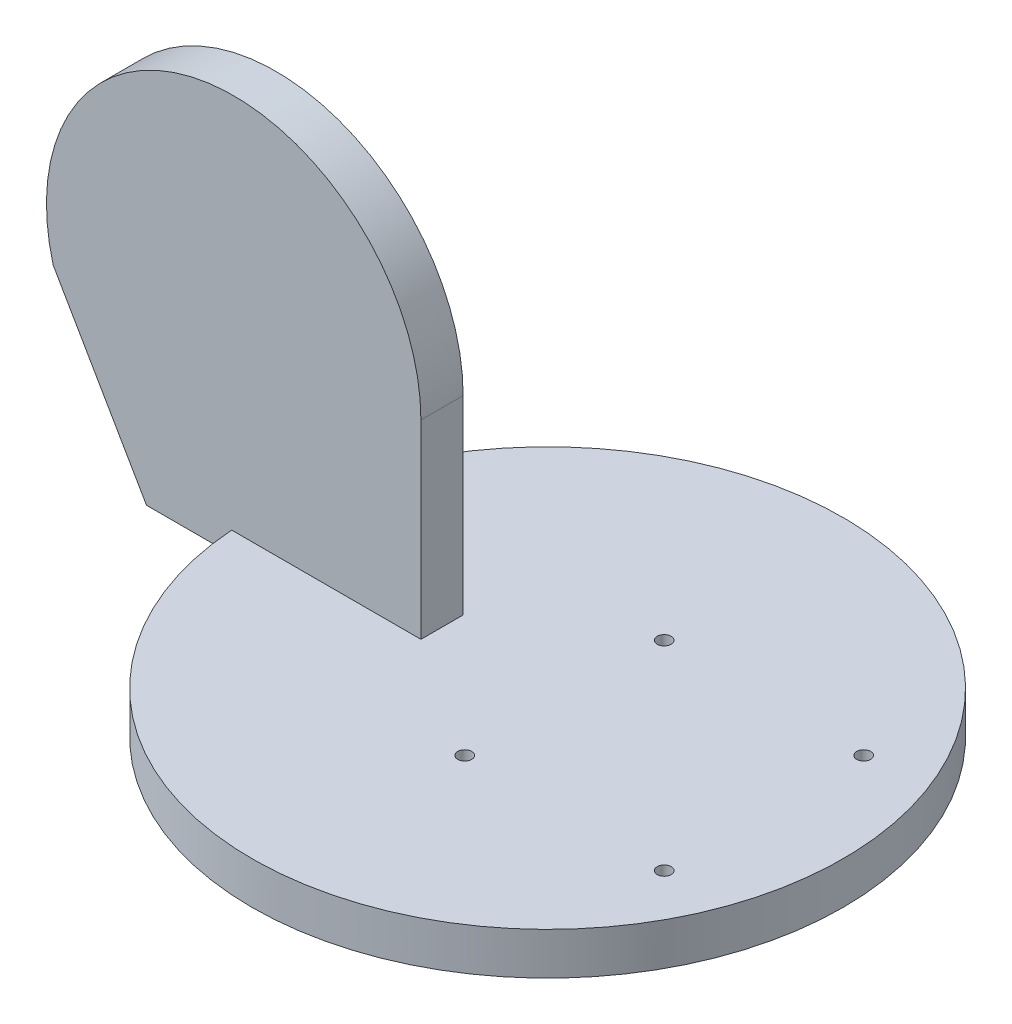
ISO-10303-21;
HEADER;
FILE_DESCRIPTION(('STEP AP214'),'2;1');
FILE_NAME('part.step','',(''),(''),'','','');
FILE_SCHEMA(('AUTOMOTIVE_DESIGN { 1 0 10303 214 1 1 1 1 }'));
ENDSEC;
DATA;
#1=APPLICATION_CONTEXT('core data for automotive mechanical design processes');
#2=APPLICATION_PROTOCOL_DEFINITION('international standard','automotive_design',2000,#1);
#3=PRODUCT_CONTEXT('',#1,'mechanical');
#4=PRODUCT('Part','Part','',(#3));
#5=PRODUCT_RELATED_PRODUCT_CATEGORY('part','',(#4));
#6=PRODUCT_DEFINITION_FORMATION('','',#4);
#7=PRODUCT_DEFINITION_CONTEXT('part definition',#1,'design');
#8=PRODUCT_DEFINITION('design','',#6,#7);
#9=PRODUCT_DEFINITION_SHAPE('','',#8);
#10=(LENGTH_UNIT() NAMED_UNIT(*) SI_UNIT(.MILLI.,.METRE.));
#11=(NAMED_UNIT(*) PLANE_ANGLE_UNIT() SI_UNIT($,.RADIAN.));
#12=(NAMED_UNIT(*) SI_UNIT($,.STERADIAN.) SOLID_ANGLE_UNIT());
#13=UNCERTAINTY_MEASURE_WITH_UNIT(LENGTH_MEASURE(1.E-05),#10,'distance_accuracy_value','');
#14=(GEOMETRIC_REPRESENTATION_CONTEXT(3) GLOBAL_UNCERTAINTY_ASSIGNED_CONTEXT((#13)) GLOBAL_UNIT_ASSIGNED_CONTEXT((#10,
#11,#12)) REPRESENTATION_CONTEXT('',''));
#15=CARTESIAN_POINT('',(0.,0.,0.));
#16=DIRECTION('',(0.,0.,1.));
#17=DIRECTION('',(1.,0.,0.));
#18=AXIS2_PLACEMENT_3D('',#15,#16,#17);
#19=CARTESIAN_POINT('',(0.,10.,0.));
#20=DIRECTION('',(0.,-1.,0.));
#21=DIRECTION('',(0.,0.,-1.));
#22=AXIS2_PLACEMENT_3D('',#19,#20,#21);
#23=CYLINDRICAL_SURFACE('',#22,70.);
#24=CARTESIAN_POINT('',(0.,0.,0.));
#25=DIRECTION('',(0.,1.,0.));
#26=DIRECTION('',(0.,0.,1.));
#27=AXIS2_PLACEMENT_3D('',#24,#25,#26);
#28=CIRCLE('',#27,70.);
#29=CARTESIAN_POINT('',(0.,0.,70.));
#30=VERTEX_POINT('',#29);
#31=EDGE_CURVE('E164',#30,#30,#28,.T.);
#32=ORIENTED_EDGE('',*,*,#31,.T.);
#33=EDGE_LOOP('',(#32));
#34=FACE_BOUND('',#33,.T.);
#35=DIRECTION('',(0.,-1.,0.));
#36=VECTOR('',#35,1.);
#37=CARTESIAN_POINT('',(-69.8212002188447,10.,5.));
#38=LINE('',#37,#36);
#39=CARTESIAN_POINT('',(-69.8212002188447,4.99999999999999,5.));
#40=VERTEX_POINT('',#39);
#41=CARTESIAN_POINT('',(-69.8212002188447,10.,5.));
#42=VERTEX_POINT('',#41);
#43=EDGE_CURVE('E50',#40,#42,#38,.F.);
#44=ORIENTED_EDGE('',*,*,#43,.F.);
#45=CARTESIAN_POINT('',(0.,5.,0.));
#46=DIRECTION('',(0.,1.,0.));
#47=DIRECTION('',(-1.,0.,0.));
#48=AXIS2_PLACEMENT_3D('',#45,#46,#47);
#49=CIRCLE('',#48,70.);
#50=CARTESIAN_POINT('',(-69.8212002188447,4.99999999999999,-5.));
#51=VERTEX_POINT('',#50);
#52=EDGE_CURVE('E11',#51,#40,#49,.T.);
#53=ORIENTED_EDGE('',*,*,#52,.F.);
#54=DIRECTION('',(0.,-1.,0.));
#55=VECTOR('',#54,1.);
#56=CARTESIAN_POINT('',(-69.8212002188447,10.,-5.));
#57=LINE('',#56,#55);
#58=CARTESIAN_POINT('',(-69.8212002188447,10.,-5.));
#59=VERTEX_POINT('',#58);
#60=EDGE_CURVE('E158',#51,#59,#57,.F.);
#61=ORIENTED_EDGE('',*,*,#60,.T.);
#62=CARTESIAN_POINT('',(0.,10.,0.));
#63=DIRECTION('',(0.,1.,0.));
#64=DIRECTION('',(0.,0.,1.));
#65=AXIS2_PLACEMENT_3D('',#62,#63,#64);
#66=CIRCLE('',#65,70.);
#67=EDGE_CURVE('E169',#42,#59,#66,.T.);
#68=ORIENTED_EDGE('',*,*,#67,.F.);
#69=EDGE_LOOP('',(#44,#53,#61,#68));
#70=FACE_BOUND('',#69,.T.);
#71=ADVANCED_FACE('F36',(#34,#70),#23,.T.);
#72=CARTESIAN_POINT('',(0.,10.,0.));
#73=DIRECTION('',(0.,1.,0.));
#74=DIRECTION('',(0.,0.,1.));
#75=AXIS2_PLACEMENT_3D('',#72,#73,#74);
#76=PLANE('',#75);
#77=CARTESIAN_POINT('',(3.99999999999997,10.,-23.622));
#78=DIRECTION('',(0.,1.,0.));
#79=DIRECTION('',(0.,0.,1.));
#80=AXIS2_PLACEMENT_3D('',#77,#78,#79);
#81=CIRCLE('',#80,1.64999999999999);
#82=CARTESIAN_POINT('',(3.99999999999997,10.,-21.972));
#83=VERTEX_POINT('',#82);
#84=EDGE_CURVE('E107',#83,#83,#81,.T.);
#85=ORIENTED_EDGE('',*,*,#84,.F.);
#86=EDGE_LOOP('',(#85));
#87=FACE_BOUND('',#86,.T.);
#88=CARTESIAN_POINT('',(51.244,10.,-23.622));
#89=DIRECTION('',(0.,1.,0.));
#90=DIRECTION('',(0.,0.,1.));
#91=AXIS2_PLACEMENT_3D('',#88,#89,#90);
#92=CIRCLE('',#91,1.64999999999999);
#93=CARTESIAN_POINT('',(51.244,10.,-21.972));
#94=VERTEX_POINT('',#93);
#95=EDGE_CURVE('E106',#94,#94,#92,.T.);
#96=ORIENTED_EDGE('',*,*,#95,.F.);
#97=EDGE_LOOP('',(#96));
#98=FACE_BOUND('',#97,.T.);
#99=CARTESIAN_POINT('',(51.244,10.,23.622));
#100=DIRECTION('',(0.,1.,0.));
#101=DIRECTION('',(0.,0.,1.));
#102=AXIS2_PLACEMENT_3D('',#99,#100,#101);
#103=CIRCLE('',#102,1.64999999999999);
#104=CARTESIAN_POINT('',(51.244,10.,25.272));
#105=VERTEX_POINT('',#104);
#106=EDGE_CURVE('E117',#105,#105,#103,.T.);
#107=ORIENTED_EDGE('',*,*,#106,.F.);
#108=EDGE_LOOP('',(#107));
#109=FACE_BOUND('',#108,.T.);
#110=CARTESIAN_POINT('',(4.,10.,23.622));
#111=DIRECTION('',(0.,1.,0.));
#112=DIRECTION('',(0.,0.,1.));
#113=AXIS2_PLACEMENT_3D('',#110,#111,#112);
#114=CIRCLE('',#113,1.64999999999999);
#115=CARTESIAN_POINT('',(4.,10.,25.272));
#116=VERTEX_POINT('',#115);
#117=EDGE_CURVE('E123',#116,#116,#114,.T.);
#118=ORIENTED_EDGE('',*,*,#117,.F.);
#119=EDGE_LOOP('',(#118));
#120=FACE_BOUND('',#119,.T.);
#121=DIRECTION('',(0.,0.,1.));
#122=VECTOR('',#121,1.);
#123=CARTESIAN_POINT('',(-25.,10.,0.));
#124=LINE('',#123,#122);
#125=CARTESIAN_POINT('',(-25.,10.,-5.));
#126=VERTEX_POINT('',#125);
#127=CARTESIAN_POINT('',(-25.,10.,5.));
#128=VERTEX_POINT('',#127);
#129=EDGE_CURVE('E175',#126,#128,#124,.T.);
#130=ORIENTED_EDGE('',*,*,#129,.T.);
#131=DIRECTION('',(-1.,0.,0.));
#132=VECTOR('',#131,1.);
#133=CARTESIAN_POINT('',(0.,10.,5.));
#134=LINE('',#133,#132);
#135=EDGE_CURVE('E43',#128,#42,#134,.T.);
#136=ORIENTED_EDGE('',*,*,#135,.T.);
#137=ORIENTED_EDGE('',*,*,#67,.T.);
#138=DIRECTION('',(-1.,0.,0.));
#139=VECTOR('',#138,1.);
#140=CARTESIAN_POINT('',(0.,10.,-5.));
#141=LINE('',#140,#139);
#142=EDGE_CURVE('E168',#126,#59,#141,.T.);
#143=ORIENTED_EDGE('',*,*,#142,.F.);
#144=EDGE_LOOP('',(#130,#136,#137,#143));
#145=FACE_BOUND('',#144,.T.);
#146=ADVANCED_FACE('F178',(#87,#98,#109,#120,#145),#76,.T.);
#147=CARTESIAN_POINT('',(0.,0.,0.));
#148=DIRECTION('',(0.,1.,0.));
#149=DIRECTION('',(0.,0.,1.));
#150=AXIS2_PLACEMENT_3D('',#147,#148,#149);
#151=PLANE('',#150);
#152=CARTESIAN_POINT('',(0.,0.,0.));
#153=DIRECTION('',(0.,-1.,0.));
#154=DIRECTION('',(0.,0.,-1.));
#155=AXIS2_PLACEMENT_3D('',#152,#153,#154);
#156=CIRCLE('',#155,65.);
#157=CARTESIAN_POINT('',(0.,0.,-65.));
#158=VERTEX_POINT('',#157);
#159=EDGE_CURVE('E165',#158,#158,#156,.T.);
#160=ORIENTED_EDGE('',*,*,#159,.F.);
#161=EDGE_LOOP('',(#160));
#162=FACE_BOUND('',#161,.T.);
#163=ORIENTED_EDGE('',*,*,#31,.F.);
#164=EDGE_LOOP('',(#163));
#165=FACE_BOUND('',#164,.T.);
#166=ADVANCED_FACE('F214',(#162,#165),#151,.F.);
#167=CARTESIAN_POINT('',(0.,-3.,0.));
#168=DIRECTION('',(0.,1.,0.));
#169=DIRECTION('',(0.,0.,1.));
#170=AXIS2_PLACEMENT_3D('',#167,#168,#169);
#171=CYLINDRICAL_SURFACE('',#170,65.);
#172=CARTESIAN_POINT('',(0.,-3.,0.));
#173=DIRECTION('',(0.,-1.,0.));
#174=DIRECTION('',(0.,0.,-1.));
#175=AXIS2_PLACEMENT_3D('',#172,#173,#174);
#176=CIRCLE('',#175,65.);
#177=CARTESIAN_POINT('',(0.,-3.,-65.));
#178=VERTEX_POINT('',#177);
#179=EDGE_CURVE('E161',#178,#178,#176,.T.);
#180=ORIENTED_EDGE('',*,*,#179,.F.);
#181=EDGE_LOOP('',(#180));
#182=FACE_BOUND('',#181,.T.);
#183=ORIENTED_EDGE('',*,*,#159,.T.);
#184=EDGE_LOOP('',(#183));
#185=FACE_BOUND('',#184,.T.);
#186=ADVANCED_FACE('F220',(#182,#185),#171,.T.);
#187=CARTESIAN_POINT('',(0.,-3.,0.));
#188=DIRECTION('',(0.,-1.,0.));
#189=DIRECTION('',(0.,0.,-1.));
#190=AXIS2_PLACEMENT_3D('',#187,#188,#189);
#191=PLANE('',#190);
#192=ORIENTED_EDGE('',*,*,#179,.T.);
#193=EDGE_LOOP('',(#192));
#194=FACE_BOUND('',#193,.T.);
#195=ADVANCED_FACE('F225',(#194),#191,.T.);
#196=CARTESIAN_POINT('',(-69.3458475312719,55.,5.));
#197=DIRECTION('',(0.,0.,-1.));
#198=DIRECTION('',(-1.,0.,0.));
#199=AXIS2_PLACEMENT_3D('',#196,#197,#198);
#200=PLANE('',#199);
#201=DIRECTION('',(1.,0.,0.));
#202=VECTOR('',#201,1.);
#203=CARTESIAN_POINT('',(-25.,4.99999999999999,5.));
#204=LINE('',#203,#202);
#205=CARTESIAN_POINT('',(-90.,4.99999999999999,5.));
#206=VERTEX_POINT('',#205);
#207=EDGE_CURVE('E136',#206,#40,#204,.T.);
#208=ORIENTED_EDGE('',*,*,#207,.T.);
#209=ORIENTED_EDGE('',*,*,#43,.T.);
#210=ORIENTED_EDGE('',*,*,#135,.F.);
#211=DIRECTION('',(0.,1.,0.));
#212=VECTOR('',#211,1.);
#213=CARTESIAN_POINT('',(-25.,55.,5.));
#214=LINE('',#213,#212);
#215=CARTESIAN_POINT('',(-25.,55.,5.));
#216=VERTEX_POINT('',#215);
#217=EDGE_CURVE('E139',#128,#216,#214,.T.);
#218=ORIENTED_EDGE('',*,*,#217,.T.);
#219=CARTESIAN_POINT('',(-69.3458475312719,55.,5.));
#220=DIRECTION('',(0.,0.,1.));
#221=DIRECTION('',(-1.,0.,0.));
#222=AXIS2_PLACEMENT_3D('',#219,#220,#221);
#223=CIRCLE('',#222,44.3458475312719);
#224=CARTESIAN_POINT('',(-112.09425777106,43.204763027493,5.));
#225=VERTEX_POINT('',#224);
#226=EDGE_CURVE('E130',#216,#225,#223,.T.);
#227=ORIENTED_EDGE('',*,*,#226,.T.);
#228=DIRECTION('',(0.500624015179347,-0.865664828571491,0.));
#229=VECTOR('',#228,1.);
#230=CARTESIAN_POINT('',(-90.,4.99999999999999,5.));
#231=LINE('',#230,#229);
#232=EDGE_CURVE('E133',#225,#206,#231,.T.);
#233=ORIENTED_EDGE('',*,*,#232,.T.);
#234=EDGE_LOOP('',(#208,#209,#210,#218,#227,#233));
#235=FACE_BOUND('',#234,.T.);
#236=ADVANCED_FACE('F182',(#235),#200,.F.);
#237=CARTESIAN_POINT('',(-69.3458475312719,55.,-5.));
#238=DIRECTION('',(0.,0.,-1.));
#239=DIRECTION('',(-1.,0.,0.));
#240=AXIS2_PLACEMENT_3D('',#237,#238,#239);
#241=PLANE('',#240);
#242=ORIENTED_EDGE('',*,*,#60,.F.);
#243=DIRECTION('',(1.,0.,0.));
#244=VECTOR('',#243,1.);
#245=CARTESIAN_POINT('',(-25.,4.99999999999999,-5.));
#246=LINE('',#245,#244);
#247=CARTESIAN_POINT('',(-90.,4.99999999999999,-5.));
#248=VERTEX_POINT('',#247);
#249=EDGE_CURVE('E146',#248,#51,#246,.T.);
#250=ORIENTED_EDGE('',*,*,#249,.F.);
#251=DIRECTION('',(0.500624015179347,-0.865664828571491,0.));
#252=VECTOR('',#251,1.);
#253=CARTESIAN_POINT('',(-90.,4.99999999999999,-5.));
#254=LINE('',#253,#252);
#255=CARTESIAN_POINT('',(-112.09425777106,43.204763027493,-5.));
#256=VERTEX_POINT('',#255);
#257=EDGE_CURVE('E144',#256,#248,#254,.T.);
#258=ORIENTED_EDGE('',*,*,#257,.F.);
#259=CARTESIAN_POINT('',(-69.3458475312719,55.,-5.));
#260=DIRECTION('',(0.,0.,1.));
#261=DIRECTION('',(-1.,0.,0.));
#262=AXIS2_PLACEMENT_3D('',#259,#260,#261);
#263=CIRCLE('',#262,44.3458475312719);
#264=CARTESIAN_POINT('',(-25.,55.,-5.));
#265=VERTEX_POINT('',#264);
#266=EDGE_CURVE('E129',#265,#256,#263,.T.);
#267=ORIENTED_EDGE('',*,*,#266,.F.);
#268=DIRECTION('',(0.,1.,0.));
#269=VECTOR('',#268,1.);
#270=CARTESIAN_POINT('',(-25.,55.,-5.));
#271=LINE('',#270,#269);
#272=EDGE_CURVE('E134',#126,#265,#271,.T.);
#273=ORIENTED_EDGE('',*,*,#272,.F.);
#274=ORIENTED_EDGE('',*,*,#142,.T.);
#275=EDGE_LOOP('',(#242,#250,#258,#267,#273,#274));
#276=FACE_BOUND('',#275,.T.);
#277=ADVANCED_FACE('F189',(#276),#241,.T.);
#278=CARTESIAN_POINT('',(-69.3458475312719,55.,5.));
#279=DIRECTION('',(0.,0.,-1.));
#280=DIRECTION('',(-1.,0.,0.));
#281=AXIS2_PLACEMENT_3D('',#278,#279,#280);
#282=CYLINDRICAL_SURFACE('',#281,44.3458475312719);
#283=ORIENTED_EDGE('',*,*,#266,.T.);
#284=DIRECTION('',(0.,0.,-1.));
#285=VECTOR('',#284,1.);
#286=CARTESIAN_POINT('',(-112.09425777106,43.204763027493,5.));
#287=LINE('',#286,#285);
#288=EDGE_CURVE('E155',#225,#256,#287,.T.);
#289=ORIENTED_EDGE('',*,*,#288,.F.);
#290=ORIENTED_EDGE('',*,*,#226,.F.);
#291=DIRECTION('',(0.,0.,-1.));
#292=VECTOR('',#291,1.);
#293=CARTESIAN_POINT('',(-25.,55.,5.));
#294=LINE('',#293,#292);
#295=EDGE_CURVE('E141',#216,#265,#294,.T.);
#296=ORIENTED_EDGE('',*,*,#295,.T.);
#297=EDGE_LOOP('',(#283,#289,#290,#296));
#298=FACE_BOUND('',#297,.T.);
#299=ADVANCED_FACE('F198',(#298),#282,.T.);
#300=CARTESIAN_POINT('',(-90.,4.99999999999999,5.));
#301=DIRECTION('',(0.865664828571491,0.500624015179347,0.));
#302=DIRECTION('',(-0.500624015179347,0.865664828571491,0.));
#303=AXIS2_PLACEMENT_3D('',#300,#301,#302);
#304=PLANE('',#303);
#305=ORIENTED_EDGE('',*,*,#257,.T.);
#306=DIRECTION('',(0.,0.,-1.));
#307=VECTOR('',#306,1.);
#308=CARTESIAN_POINT('',(-90.,4.99999999999999,5.));
#309=LINE('',#308,#307);
#310=EDGE_CURVE('E152',#206,#248,#309,.T.);
#311=ORIENTED_EDGE('',*,*,#310,.F.);
#312=ORIENTED_EDGE('',*,*,#232,.F.);
#313=ORIENTED_EDGE('',*,*,#288,.T.);
#314=EDGE_LOOP('',(#305,#311,#312,#313));
#315=FACE_BOUND('',#314,.T.);
#316=ADVANCED_FACE('F200',(#315),#304,.F.);
#317=CARTESIAN_POINT('',(-25.,4.99999999999999,5.));
#318=DIRECTION('',(0.,1.,0.));
#319=DIRECTION('',(-1.,0.,0.));
#320=AXIS2_PLACEMENT_3D('',#317,#318,#319);
#321=PLANE('',#320);
#322=ORIENTED_EDGE('',*,*,#249,.T.);
#323=ORIENTED_EDGE('',*,*,#52,.T.);
#324=ORIENTED_EDGE('',*,*,#207,.F.);
#325=ORIENTED_EDGE('',*,*,#310,.T.);
#326=EDGE_LOOP('',(#322,#323,#324,#325));
#327=FACE_BOUND('',#326,.T.);
#328=ADVANCED_FACE('F186',(#327),#321,.F.);
#329=CARTESIAN_POINT('',(-25.,55.,5.));
#330=DIRECTION('',(-1.,0.,0.));
#331=DIRECTION('',(0.,-1.,0.));
#332=AXIS2_PLACEMENT_3D('',#329,#330,#331);
#333=PLANE('',#332);
#334=ORIENTED_EDGE('',*,*,#129,.F.);
#335=ORIENTED_EDGE('',*,*,#272,.T.);
#336=ORIENTED_EDGE('',*,*,#295,.F.);
#337=ORIENTED_EDGE('',*,*,#217,.F.);
#338=EDGE_LOOP('',(#334,#335,#336,#337));
#339=FACE_BOUND('',#338,.T.);
#340=ADVANCED_FACE('F193',(#339),#333,.F.);
#341=CARTESIAN_POINT('',(4.,-0.0999999999999977,23.622));
#342=DIRECTION('',(0.,1.,0.));
#343=DIRECTION('',(0.,0.,1.));
#344=AXIS2_PLACEMENT_3D('',#341,#342,#343);
#345=CONICAL_SURFACE('',#344,1.64999999999999,1.02974425867665);
#346=CARTESIAN_POINT('',(4.,-1.09142002139547,23.622));
#347=VERTEX_POINT('',#346);
#348=VERTEX_LOOP('',#347);
#349=FACE_BOUND('',#348,.T.);
#350=CARTESIAN_POINT('',(4.,-0.0999999999999977,23.622));
#351=DIRECTION('',(0.,1.,0.));
#352=DIRECTION('',(0.,0.,1.));
#353=AXIS2_PLACEMENT_3D('',#350,#351,#352);
#354=CIRCLE('',#353,1.64999999999999);
#355=CARTESIAN_POINT('',(4.,-0.0999999999999977,25.272));
#356=VERTEX_POINT('',#355);
#357=EDGE_CURVE('E126',#356,#356,#354,.T.);
#358=ORIENTED_EDGE('',*,*,#357,.T.);
#359=EDGE_LOOP('',(#358));
#360=FACE_BOUND('',#359,.T.);
#361=ADVANCED_FACE('F243',(#349,#360),#345,.F.);
#362=CARTESIAN_POINT('',(4.,10.,23.622));
#363=DIRECTION('',(0.,1.,0.));
#364=DIRECTION('',(0.,0.,1.));
#365=AXIS2_PLACEMENT_3D('',#362,#363,#364);
#366=CYLINDRICAL_SURFACE('',#365,1.64999999999999);
#367=ORIENTED_EDGE('',*,*,#357,.F.);
#368=EDGE_LOOP('',(#367));
#369=FACE_BOUND('',#368,.T.);
#370=ORIENTED_EDGE('',*,*,#117,.T.);
#371=EDGE_LOOP('',(#370));
#372=FACE_BOUND('',#371,.T.);
#373=ADVANCED_FACE('F250',(#369,#372),#366,.F.);
#374=CARTESIAN_POINT('',(51.244,-0.0999999999999977,23.622));
#375=DIRECTION('',(0.,1.,0.));
#376=DIRECTION('',(0.,0.,1.));
#377=AXIS2_PLACEMENT_3D('',#374,#375,#376);
#378=CONICAL_SURFACE('',#377,1.64999999999998,1.02974425867665);
#379=CARTESIAN_POINT('',(51.244,-1.09142002139547,23.622));
#380=VERTEX_POINT('',#379);
#381=VERTEX_LOOP('',#380);
#382=FACE_BOUND('',#381,.T.);
#383=CARTESIAN_POINT('',(51.244,-0.0999999999999977,23.622));
#384=DIRECTION('',(0.,1.,0.));
#385=DIRECTION('',(0.,0.,1.));
#386=AXIS2_PLACEMENT_3D('',#383,#384,#385);
#387=CIRCLE('',#386,1.64999999999998);
#388=CARTESIAN_POINT('',(51.244,-0.0999999999999977,25.272));
#389=VERTEX_POINT('',#388);
#390=EDGE_CURVE('E120',#389,#389,#387,.T.);
#391=ORIENTED_EDGE('',*,*,#390,.T.);
#392=EDGE_LOOP('',(#391));
#393=FACE_BOUND('',#392,.T.);
#394=ADVANCED_FACE('F255',(#382,#393),#378,.F.);
#395=CARTESIAN_POINT('',(51.244,10.,23.622));
#396=DIRECTION('',(0.,1.,0.));
#397=DIRECTION('',(0.,0.,1.));
#398=AXIS2_PLACEMENT_3D('',#395,#396,#397);
#399=CYLINDRICAL_SURFACE('',#398,1.64999999999999);
#400=ORIENTED_EDGE('',*,*,#390,.F.);
#401=EDGE_LOOP('',(#400));
#402=FACE_BOUND('',#401,.T.);
#403=ORIENTED_EDGE('',*,*,#106,.T.);
#404=EDGE_LOOP('',(#403));
#405=FACE_BOUND('',#404,.T.);
#406=ADVANCED_FACE('F265',(#402,#405),#399,.F.);
#407=CARTESIAN_POINT('',(51.244,-0.0999999999999977,-23.622));
#408=DIRECTION('',(0.,1.,0.));
#409=DIRECTION('',(0.,0.,1.));
#410=AXIS2_PLACEMENT_3D('',#407,#408,#409);
#411=CONICAL_SURFACE('',#410,1.64999999999998,1.02974425867665);
#412=CARTESIAN_POINT('',(51.244,-1.09142002139547,-23.622));
#413=VERTEX_POINT('',#412);
#414=VERTEX_LOOP('',#413);
#415=FACE_BOUND('',#414,.T.);
#416=CARTESIAN_POINT('',(51.244,-0.0999999999999977,-23.622));
#417=DIRECTION('',(0.,1.,0.));
#418=DIRECTION('',(0.,0.,1.));
#419=AXIS2_PLACEMENT_3D('',#416,#417,#418);
#420=CIRCLE('',#419,1.64999999999998);
#421=CARTESIAN_POINT('',(51.244,-0.0999999999999977,-21.972));
#422=VERTEX_POINT('',#421);
#423=EDGE_CURVE('E110',#422,#422,#420,.T.);
#424=ORIENTED_EDGE('',*,*,#423,.T.);
#425=EDGE_LOOP('',(#424));
#426=FACE_BOUND('',#425,.T.);
#427=ADVANCED_FACE('F271',(#415,#426),#411,.F.);
#428=CARTESIAN_POINT('',(51.244,10.,-23.622));
#429=DIRECTION('',(0.,1.,0.));
#430=DIRECTION('',(0.,0.,1.));
#431=AXIS2_PLACEMENT_3D('',#428,#429,#430);
#432=CYLINDRICAL_SURFACE('',#431,1.64999999999999);
#433=ORIENTED_EDGE('',*,*,#423,.F.);
#434=EDGE_LOOP('',(#433));
#435=FACE_BOUND('',#434,.T.);
#436=ORIENTED_EDGE('',*,*,#95,.T.);
#437=EDGE_LOOP('',(#436));
#438=FACE_BOUND('',#437,.T.);
#439=ADVANCED_FACE('F100',(#435,#438),#432,.F.);
#440=CARTESIAN_POINT('',(3.99999999999997,-0.0999999999999977,-23.622));
#441=DIRECTION('',(0.,1.,0.));
#442=DIRECTION('',(0.,0.,1.));
#443=AXIS2_PLACEMENT_3D('',#440,#441,#442);
#444=CONICAL_SURFACE('',#443,1.64999999999999,1.02974425867665);
#445=CARTESIAN_POINT('',(3.99999999999997,-1.09142002139547,-23.622));
#446=VERTEX_POINT('',#445);
#447=VERTEX_LOOP('',#446);
#448=FACE_BOUND('',#447,.T.);
#449=CARTESIAN_POINT('',(3.99999999999997,-0.0999999999999977,-23.622));
#450=DIRECTION('',(0.,1.,0.));
#451=DIRECTION('',(0.,0.,1.));
#452=AXIS2_PLACEMENT_3D('',#449,#450,#451);
#453=CIRCLE('',#452,1.64999999999999);
#454=CARTESIAN_POINT('',(3.99999999999997,-0.0999999999999977,-21.972));
#455=VERTEX_POINT('',#454);
#456=EDGE_CURVE('E104',#455,#455,#453,.T.);
#457=ORIENTED_EDGE('',*,*,#456,.T.);
#458=EDGE_LOOP('',(#457));
#459=FACE_BOUND('',#458,.T.);
#460=ADVANCED_FACE('F96',(#448,#459),#444,.F.);
#461=CARTESIAN_POINT('',(3.99999999999997,10.,-23.622));
#462=DIRECTION('',(0.,1.,0.));
#463=DIRECTION('',(0.,0.,1.));
#464=AXIS2_PLACEMENT_3D('',#461,#462,#463);
#465=CYLINDRICAL_SURFACE('',#464,1.64999999999999);
#466=ORIENTED_EDGE('',*,*,#456,.F.);
#467=EDGE_LOOP('',(#466));
#468=FACE_BOUND('',#467,.T.);
#469=ORIENTED_EDGE('',*,*,#84,.T.);
#470=EDGE_LOOP('',(#469));
#471=FACE_BOUND('',#470,.T.);
#472=ADVANCED_FACE('F99',(#468,#471),#465,.F.);
#473=CLOSED_SHELL('',(#71,#146,#166,#186,#195,#236,#277,#299,#316,#328,#340,#361,#373,#394,#406,
#427,#439,#460,#472));
#474=MANIFOLD_SOLID_BREP('B2',#473);
#475=ADVANCED_BREP_SHAPE_REPRESENTATION('',(#18,#474),#14);
#476=SHAPE_DEFINITION_REPRESENTATION(#9,#475);
ENDSEC;
END-ISO-10303-21;
